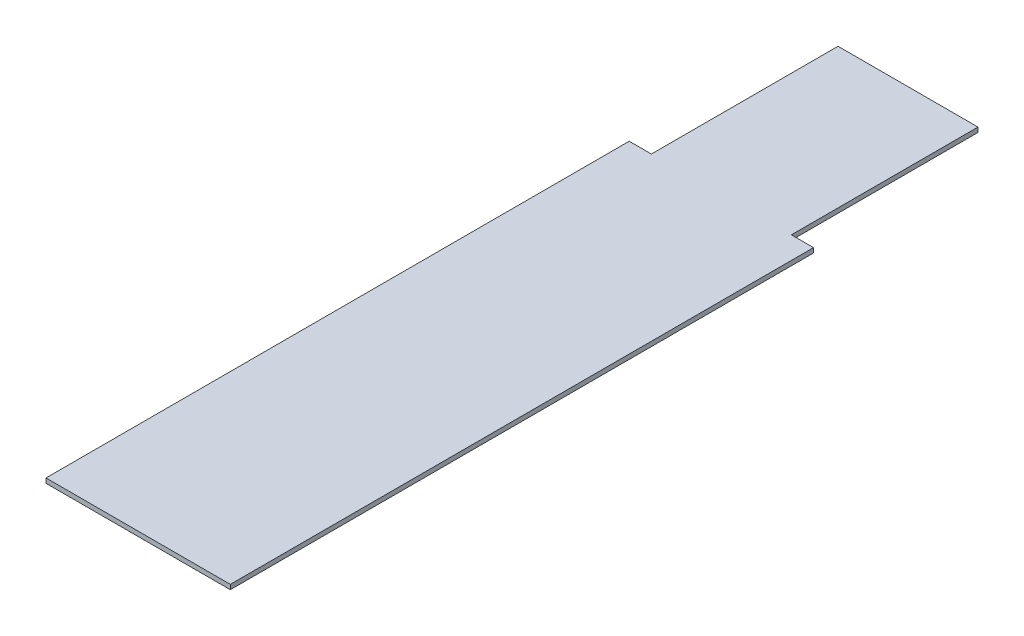
ISO-10303-21;
HEADER;
FILE_DESCRIPTION(('STEP AP214'),'2;1');
FILE_NAME('part.step','',(''),(''),'','','');
FILE_SCHEMA(('AUTOMOTIVE_DESIGN { 1 0 10303 214 1 1 1 1 }'));
ENDSEC;
DATA;
#1=APPLICATION_CONTEXT('core data for automotive mechanical design processes');
#2=APPLICATION_PROTOCOL_DEFINITION('international standard','automotive_design',2000,#1);
#3=PRODUCT_CONTEXT('',#1,'mechanical');
#4=PRODUCT('Part','Part','',(#3));
#5=PRODUCT_RELATED_PRODUCT_CATEGORY('part','',(#4));
#6=PRODUCT_DEFINITION_FORMATION('','',#4);
#7=PRODUCT_DEFINITION_CONTEXT('part definition',#1,'design');
#8=PRODUCT_DEFINITION('design','',#6,#7);
#9=PRODUCT_DEFINITION_SHAPE('','',#8);
#10=(LENGTH_UNIT() NAMED_UNIT(*) SI_UNIT(.MILLI.,.METRE.));
#11=(NAMED_UNIT(*) PLANE_ANGLE_UNIT() SI_UNIT($,.RADIAN.));
#12=(NAMED_UNIT(*) SI_UNIT($,.STERADIAN.) SOLID_ANGLE_UNIT());
#13=UNCERTAINTY_MEASURE_WITH_UNIT(LENGTH_MEASURE(1.E-05),#10,'distance_accuracy_value','');
#14=(GEOMETRIC_REPRESENTATION_CONTEXT(3) GLOBAL_UNCERTAINTY_ASSIGNED_CONTEXT((#13)) GLOBAL_UNIT_ASSIGNED_CONTEXT((#10,
#11,#12)) REPRESENTATION_CONTEXT('',''));
#15=CARTESIAN_POINT('',(0.,0.,0.));
#16=DIRECTION('',(0.,0.,1.));
#17=DIRECTION('',(1.,0.,0.));
#18=AXIS2_PLACEMENT_3D('',#15,#16,#17);
#19=CARTESIAN_POINT('',(-3.95,0.2,12.5));
#20=DIRECTION('',(1.,0.,0.));
#21=DIRECTION('',(0.,0.,-1.));
#22=AXIS2_PLACEMENT_3D('',#19,#20,#21);
#23=PLANE('',#22);
#24=DIRECTION('',(0.,0.,1.));
#25=VECTOR('',#24,1.);
#26=CARTESIAN_POINT('',(-3.95,0.,12.5));
#27=LINE('',#26,#25);
#28=CARTESIAN_POINT('',(-3.95,0.,-12.5));
#29=VERTEX_POINT('',#28);
#30=CARTESIAN_POINT('',(-3.95,0.,12.5));
#31=VERTEX_POINT('',#30);
#32=EDGE_CURVE('E140',#29,#31,#27,.T.);
#33=ORIENTED_EDGE('',*,*,#32,.T.);
#34=DIRECTION('',(0.,-1.,0.));
#35=VECTOR('',#34,1.);
#36=CARTESIAN_POINT('',(-3.95,0.2,12.5));
#37=LINE('',#36,#35);
#38=CARTESIAN_POINT('',(-3.95,0.2,12.5));
#39=VERTEX_POINT('',#38);
#40=EDGE_CURVE('E11',#39,#31,#37,.T.);
#41=ORIENTED_EDGE('',*,*,#40,.F.);
#42=DIRECTION('',(0.,0.,1.));
#43=VECTOR('',#42,1.);
#44=CARTESIAN_POINT('',(-3.95,0.2,12.5));
#45=LINE('',#44,#43);
#46=CARTESIAN_POINT('',(-3.95,0.2,-12.5));
#47=VERTEX_POINT('',#46);
#48=EDGE_CURVE('E162',#47,#39,#45,.T.);
#49=ORIENTED_EDGE('',*,*,#48,.F.);
#50=DIRECTION('',(0.,-1.,0.));
#51=VECTOR('',#50,1.);
#52=CARTESIAN_POINT('',(-3.95,0.2,-12.5));
#53=LINE('',#52,#51);
#54=EDGE_CURVE('E136',#47,#29,#53,.T.);
#55=ORIENTED_EDGE('',*,*,#54,.T.);
#56=EDGE_LOOP('',(#33,#41,#49,#55));
#57=FACE_BOUND('',#56,.T.);
#58=ADVANCED_FACE('F39',(#57),#23,.F.);
#59=CARTESIAN_POINT('',(3.95,0.2,12.5));
#60=DIRECTION('',(0.,0.,-1.));
#61=DIRECTION('',(-1.,0.,0.));
#62=AXIS2_PLACEMENT_3D('',#59,#60,#61);
#63=PLANE('',#62);
#64=DIRECTION('',(1.,0.,0.));
#65=VECTOR('',#64,1.);
#66=CARTESIAN_POINT('',(3.95,0.,12.5));
#67=LINE('',#66,#65);
#68=CARTESIAN_POINT('',(3.95,0.,12.5));
#69=VERTEX_POINT('',#68);
#70=EDGE_CURVE('E144',#31,#69,#67,.T.);
#71=ORIENTED_EDGE('',*,*,#70,.T.);
#72=DIRECTION('',(0.,-1.,0.));
#73=VECTOR('',#72,1.);
#74=CARTESIAN_POINT('',(3.95,0.2,12.5));
#75=LINE('',#74,#73);
#76=CARTESIAN_POINT('',(3.95,0.2,12.5));
#77=VERTEX_POINT('',#76);
#78=EDGE_CURVE('E48',#77,#69,#75,.T.);
#79=ORIENTED_EDGE('',*,*,#78,.F.);
#80=DIRECTION('',(1.,0.,0.));
#81=VECTOR('',#80,1.);
#82=CARTESIAN_POINT('',(3.95,0.2,12.5));
#83=LINE('',#82,#81);
#84=EDGE_CURVE('E99',#39,#77,#83,.T.);
#85=ORIENTED_EDGE('',*,*,#84,.F.);
#86=ORIENTED_EDGE('',*,*,#40,.T.);
#87=EDGE_LOOP('',(#71,#79,#85,#86));
#88=FACE_BOUND('',#87,.T.);
#89=ADVANCED_FACE('F208',(#88),#63,.F.);
#90=CARTESIAN_POINT('',(3.95,0.2,12.5));
#91=DIRECTION('',(-1.,0.,0.));
#92=DIRECTION('',(0.,0.,1.));
#93=AXIS2_PLACEMENT_3D('',#90,#91,#92);
#94=PLANE('',#93);
#95=DIRECTION('',(0.,0.,-1.));
#96=VECTOR('',#95,1.);
#97=CARTESIAN_POINT('',(3.95,0.,12.5));
#98=LINE('',#97,#96);
#99=CARTESIAN_POINT('',(3.95,0.,-12.5));
#100=VERTEX_POINT('',#99);
#101=EDGE_CURVE('E147',#69,#100,#98,.T.);
#102=ORIENTED_EDGE('',*,*,#101,.T.);
#103=DIRECTION('',(0.,-1.,0.));
#104=VECTOR('',#103,1.);
#105=CARTESIAN_POINT('',(3.95,0.2,-12.5));
#106=LINE('',#105,#104);
#107=CARTESIAN_POINT('',(3.95,0.2,-12.5));
#108=VERTEX_POINT('',#107);
#109=EDGE_CURVE('E173',#108,#100,#106,.T.);
#110=ORIENTED_EDGE('',*,*,#109,.F.);
#111=DIRECTION('',(0.,0.,-1.));
#112=VECTOR('',#111,1.);
#113=CARTESIAN_POINT('',(3.95,0.2,12.5));
#114=LINE('',#113,#112);
#115=EDGE_CURVE('E183',#77,#108,#114,.T.);
#116=ORIENTED_EDGE('',*,*,#115,.F.);
#117=ORIENTED_EDGE('',*,*,#78,.T.);
#118=EDGE_LOOP('',(#102,#110,#116,#117));
#119=FACE_BOUND('',#118,.T.);
#120=ADVANCED_FACE('F181',(#119),#94,.F.);
#121=CARTESIAN_POINT('',(3.95,0.2,-12.5));
#122=DIRECTION('',(0.,0.,1.));
#123=DIRECTION('',(1.,0.,0.));
#124=AXIS2_PLACEMENT_3D('',#121,#122,#123);
#125=PLANE('',#124);
#126=DIRECTION('',(-1.,0.,0.));
#127=VECTOR('',#126,1.);
#128=CARTESIAN_POINT('',(3.95,0.,-12.5));
#129=LINE('',#128,#127);
#130=CARTESIAN_POINT('',(3.,0.,-12.5));
#131=VERTEX_POINT('',#130);
#132=EDGE_CURVE('E150',#100,#131,#129,.T.);
#133=ORIENTED_EDGE('',*,*,#132,.T.);
#134=DIRECTION('',(0.,-1.,0.));
#135=VECTOR('',#134,1.);
#136=CARTESIAN_POINT('',(3.,0.2,-12.5));
#137=LINE('',#136,#135);
#138=CARTESIAN_POINT('',(3.,0.2,-12.5));
#139=VERTEX_POINT('',#138);
#140=EDGE_CURVE('E169',#139,#131,#137,.T.);
#141=ORIENTED_EDGE('',*,*,#140,.F.);
#142=DIRECTION('',(-1.,0.,0.));
#143=VECTOR('',#142,1.);
#144=CARTESIAN_POINT('',(3.95,0.2,-12.5));
#145=LINE('',#144,#143);
#146=EDGE_CURVE('E196',#108,#139,#145,.T.);
#147=ORIENTED_EDGE('',*,*,#146,.F.);
#148=ORIENTED_EDGE('',*,*,#109,.T.);
#149=EDGE_LOOP('',(#133,#141,#147,#148));
#150=FACE_BOUND('',#149,.T.);
#151=ADVANCED_FACE('F191',(#150),#125,.F.);
#152=CARTESIAN_POINT('',(3.,0.2,-20.5));
#153=DIRECTION('',(-1.,0.,0.));
#154=DIRECTION('',(0.,0.,1.));
#155=AXIS2_PLACEMENT_3D('',#152,#153,#154);
#156=PLANE('',#155);
#157=DIRECTION('',(0.,0.,-1.));
#158=VECTOR('',#157,1.);
#159=CARTESIAN_POINT('',(3.,0.,-20.5));
#160=LINE('',#159,#158);
#161=CARTESIAN_POINT('',(3.,0.,-20.5));
#162=VERTEX_POINT('',#161);
#163=EDGE_CURVE('E153',#131,#162,#160,.T.);
#164=ORIENTED_EDGE('',*,*,#163,.T.);
#165=DIRECTION('',(0.,-1.,0.));
#166=VECTOR('',#165,1.);
#167=CARTESIAN_POINT('',(3.,0.2,-20.5));
#168=LINE('',#167,#166);
#169=CARTESIAN_POINT('',(3.,0.2,-20.5));
#170=VERTEX_POINT('',#169);
#171=EDGE_CURVE('E129',#170,#162,#168,.T.);
#172=ORIENTED_EDGE('',*,*,#171,.F.);
#173=DIRECTION('',(0.,0.,-1.));
#174=VECTOR('',#173,1.);
#175=CARTESIAN_POINT('',(3.,0.2,-20.5));
#176=LINE('',#175,#174);
#177=EDGE_CURVE('E118',#139,#170,#176,.T.);
#178=ORIENTED_EDGE('',*,*,#177,.F.);
#179=ORIENTED_EDGE('',*,*,#140,.T.);
#180=EDGE_LOOP('',(#164,#172,#178,#179));
#181=FACE_BOUND('',#180,.T.);
#182=ADVANCED_FACE('F194',(#181),#156,.F.);
#183=CARTESIAN_POINT('',(3.,0.2,-20.5));
#184=DIRECTION('',(0.,0.,1.));
#185=DIRECTION('',(1.,0.,0.));
#186=AXIS2_PLACEMENT_3D('',#183,#184,#185);
#187=PLANE('',#186);
#188=DIRECTION('',(-1.,0.,0.));
#189=VECTOR('',#188,1.);
#190=CARTESIAN_POINT('',(3.,0.,-20.5));
#191=LINE('',#190,#189);
#192=CARTESIAN_POINT('',(-3.,0.,-20.5));
#193=VERTEX_POINT('',#192);
#194=EDGE_CURVE('E127',#162,#193,#191,.T.);
#195=ORIENTED_EDGE('',*,*,#194,.T.);
#196=DIRECTION('',(0.,-1.,0.));
#197=VECTOR('',#196,1.);
#198=CARTESIAN_POINT('',(-3.,0.2,-20.5));
#199=LINE('',#198,#197);
#200=CARTESIAN_POINT('',(-3.,0.2,-20.5));
#201=VERTEX_POINT('',#200);
#202=EDGE_CURVE('E124',#201,#193,#199,.T.);
#203=ORIENTED_EDGE('',*,*,#202,.F.);
#204=DIRECTION('',(-1.,0.,0.));
#205=VECTOR('',#204,1.);
#206=CARTESIAN_POINT('',(3.,0.2,-20.5));
#207=LINE('',#206,#205);
#208=EDGE_CURVE('E112',#170,#201,#207,.T.);
#209=ORIENTED_EDGE('',*,*,#208,.F.);
#210=ORIENTED_EDGE('',*,*,#171,.T.);
#211=EDGE_LOOP('',(#195,#203,#209,#210));
#212=FACE_BOUND('',#211,.T.);
#213=ADVANCED_FACE('F125',(#212),#187,.F.);
#214=CARTESIAN_POINT('',(-3.,0.2,-20.5));
#215=DIRECTION('',(1.,0.,0.));
#216=DIRECTION('',(0.,0.,-1.));
#217=AXIS2_PLACEMENT_3D('',#214,#215,#216);
#218=PLANE('',#217);
#219=DIRECTION('',(0.,0.,1.));
#220=VECTOR('',#219,1.);
#221=CARTESIAN_POINT('',(-3.,0.,-20.5));
#222=LINE('',#221,#220);
#223=CARTESIAN_POINT('',(-3.,0.,-12.5));
#224=VERTEX_POINT('',#223);
#225=EDGE_CURVE('E85',#193,#224,#222,.T.);
#226=ORIENTED_EDGE('',*,*,#225,.T.);
#227=DIRECTION('',(0.,-1.,0.));
#228=VECTOR('',#227,1.);
#229=CARTESIAN_POINT('',(-3.,0.2,-12.5));
#230=LINE('',#229,#228);
#231=CARTESIAN_POINT('',(-3.,0.2,-12.5));
#232=VERTEX_POINT('',#231);
#233=EDGE_CURVE('E130',#232,#224,#230,.T.);
#234=ORIENTED_EDGE('',*,*,#233,.F.);
#235=DIRECTION('',(0.,0.,1.));
#236=VECTOR('',#235,1.);
#237=CARTESIAN_POINT('',(-3.,0.2,-20.5));
#238=LINE('',#237,#236);
#239=EDGE_CURVE('E116',#201,#232,#238,.T.);
#240=ORIENTED_EDGE('',*,*,#239,.F.);
#241=ORIENTED_EDGE('',*,*,#202,.T.);
#242=EDGE_LOOP('',(#226,#234,#240,#241));
#243=FACE_BOUND('',#242,.T.);
#244=ADVANCED_FACE('F132',(#243),#218,.F.);
#245=CARTESIAN_POINT('',(-3.,0.2,-12.5));
#246=DIRECTION('',(0.,0.,1.));
#247=DIRECTION('',(1.,0.,0.));
#248=AXIS2_PLACEMENT_3D('',#245,#246,#247);
#249=PLANE('',#248);
#250=DIRECTION('',(-1.,0.,0.));
#251=VECTOR('',#250,1.);
#252=CARTESIAN_POINT('',(-3.,0.,-12.5));
#253=LINE('',#252,#251);
#254=EDGE_CURVE('E91',#224,#29,#253,.T.);
#255=ORIENTED_EDGE('',*,*,#254,.T.);
#256=ORIENTED_EDGE('',*,*,#54,.F.);
#257=DIRECTION('',(-1.,0.,0.));
#258=VECTOR('',#257,1.);
#259=CARTESIAN_POINT('',(-3.,0.2,-12.5));
#260=LINE('',#259,#258);
#261=EDGE_CURVE('E56',#232,#47,#260,.T.);
#262=ORIENTED_EDGE('',*,*,#261,.F.);
#263=ORIENTED_EDGE('',*,*,#233,.T.);
#264=EDGE_LOOP('',(#255,#256,#262,#263));
#265=FACE_BOUND('',#264,.T.);
#266=ADVANCED_FACE('F224',(#265),#249,.F.);
#267=CARTESIAN_POINT('',(0.,0.2,0.));
#268=DIRECTION('',(0.,1.,0.));
#269=DIRECTION('',(0.,0.,1.));
#270=AXIS2_PLACEMENT_3D('',#267,#268,#269);
#271=PLANE('',#270);
#272=ORIENTED_EDGE('',*,*,#48,.T.);
#273=ORIENTED_EDGE('',*,*,#84,.T.);
#274=ORIENTED_EDGE('',*,*,#115,.T.);
#275=ORIENTED_EDGE('',*,*,#146,.T.);
#276=ORIENTED_EDGE('',*,*,#177,.T.);
#277=ORIENTED_EDGE('',*,*,#208,.T.);
#278=ORIENTED_EDGE('',*,*,#239,.T.);
#279=ORIENTED_EDGE('',*,*,#261,.T.);
#280=EDGE_LOOP('',(#272,#273,#274,#275,#276,#277,#278,#279));
#281=FACE_BOUND('',#280,.T.);
#282=ADVANCED_FACE('F114',(#281),#271,.T.);
#283=CARTESIAN_POINT('',(0.,0.,0.));
#284=DIRECTION('',(0.,1.,0.));
#285=DIRECTION('',(0.,0.,1.));
#286=AXIS2_PLACEMENT_3D('',#283,#284,#285);
#287=PLANE('',#286);
#288=ORIENTED_EDGE('',*,*,#32,.F.);
#289=ORIENTED_EDGE('',*,*,#254,.F.);
#290=ORIENTED_EDGE('',*,*,#225,.F.);
#291=ORIENTED_EDGE('',*,*,#194,.F.);
#292=ORIENTED_EDGE('',*,*,#163,.F.);
#293=ORIENTED_EDGE('',*,*,#132,.F.);
#294=ORIENTED_EDGE('',*,*,#101,.F.);
#295=ORIENTED_EDGE('',*,*,#70,.F.);
#296=EDGE_LOOP('',(#288,#289,#290,#291,#292,#293,#294,#295));
#297=FACE_BOUND('',#296,.T.);
#298=ADVANCED_FACE('F187',(#297),#287,.F.);
#299=CLOSED_SHELL('',(#58,#89,#120,#151,#182,#213,#244,#266,#282,#298));
#300=MANIFOLD_SOLID_BREP('B2',#299);
#301=ADVANCED_BREP_SHAPE_REPRESENTATION('',(#18,#300),#14);
#302=SHAPE_DEFINITION_REPRESENTATION(#9,#301);
ENDSEC;
END-ISO-10303-21;
